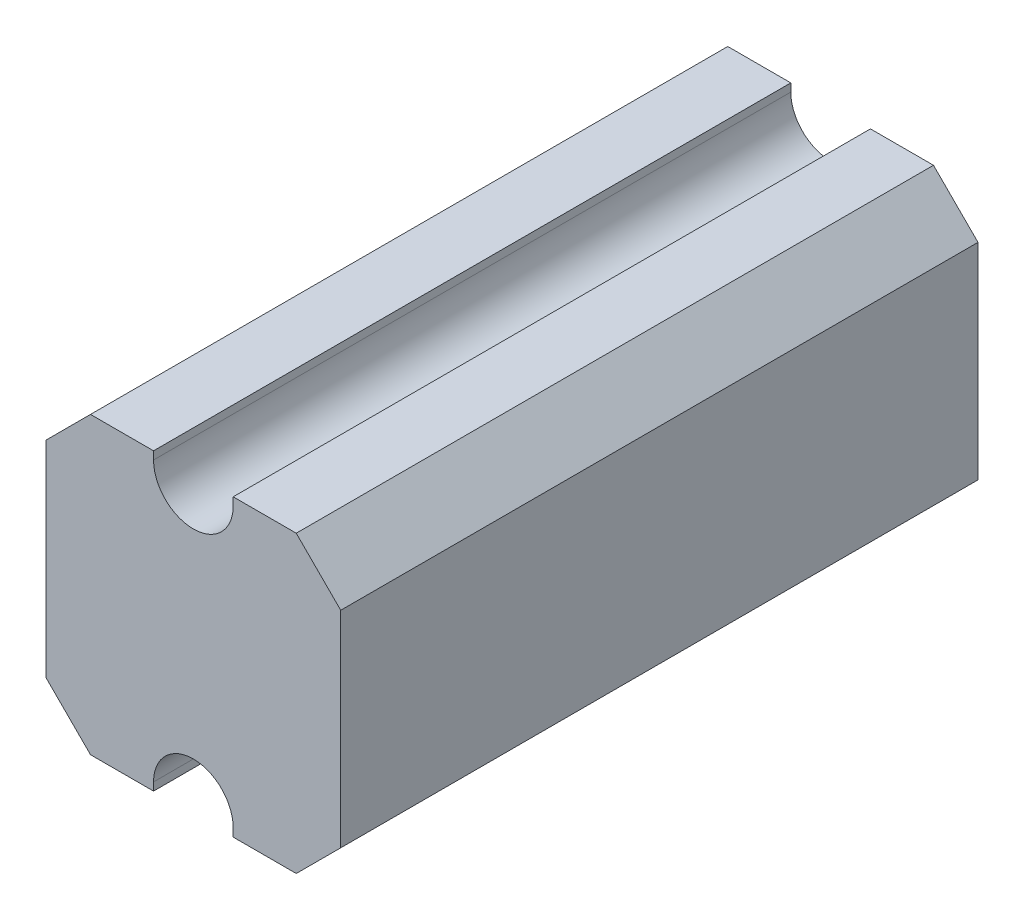
ISO-10303-21;
HEADER;
FILE_DESCRIPTION(('STEP AP214'),'2;1');
FILE_NAME('part.step','',(''),(''),'','','');
FILE_SCHEMA(('AUTOMOTIVE_DESIGN { 1 0 10303 214 1 1 1 1 }'));
ENDSEC;
DATA;
#1=APPLICATION_CONTEXT('core data for automotive mechanical design processes');
#2=APPLICATION_PROTOCOL_DEFINITION('international standard','automotive_design',2000,#1);
#3=PRODUCT_CONTEXT('',#1,'mechanical');
#4=PRODUCT('Part','Part','',(#3));
#5=PRODUCT_RELATED_PRODUCT_CATEGORY('part','',(#4));
#6=PRODUCT_DEFINITION_FORMATION('','',#4);
#7=PRODUCT_DEFINITION_CONTEXT('part definition',#1,'design');
#8=PRODUCT_DEFINITION('design','',#6,#7);
#9=PRODUCT_DEFINITION_SHAPE('','',#8);
#10=(LENGTH_UNIT() NAMED_UNIT(*) SI_UNIT(.MILLI.,.METRE.));
#11=(NAMED_UNIT(*) PLANE_ANGLE_UNIT() SI_UNIT($,.RADIAN.));
#12=(NAMED_UNIT(*) SI_UNIT($,.STERADIAN.) SOLID_ANGLE_UNIT());
#13=UNCERTAINTY_MEASURE_WITH_UNIT(LENGTH_MEASURE(1.E-05),#10,'distance_accuracy_value','');
#14=(GEOMETRIC_REPRESENTATION_CONTEXT(3) GLOBAL_UNCERTAINTY_ASSIGNED_CONTEXT((#13)) GLOBAL_UNIT_ASSIGNED_CONTEXT((#10,
#11,#12)) REPRESENTATION_CONTEXT('',''));
#15=CARTESIAN_POINT('',(0.,0.,0.));
#16=DIRECTION('',(0.,0.,1.));
#17=DIRECTION('',(1.,0.,0.));
#18=AXIS2_PLACEMENT_3D('',#15,#16,#17);
#19=CARTESIAN_POINT('',(-49.9999999999998,0.,-800.));
#20=DIRECTION('',(-1.,0.,0.));
#21=DIRECTION('',(0.,-1.,0.));
#22=AXIS2_PLACEMENT_3D('',#19,#20,#21);
#23=PLANE('',#22);
#24=DIRECTION('',(0.,-1.,0.));
#25=VECTOR('',#24,1.);
#26=CARTESIAN_POINT('',(-49.9999999999998,0.,0.));
#27=LINE('',#26,#25);
#28=CARTESIAN_POINT('',(-50.,-175.,0.));
#29=VERTEX_POINT('',#28);
#30=CARTESIAN_POINT('',(-50.,-185.,0.));
#31=VERTEX_POINT('',#30);
#32=EDGE_CURVE('E184',#29,#31,#27,.T.);
#33=ORIENTED_EDGE('',*,*,#32,.T.);
#34=DIRECTION('',(0.,0.,1.));
#35=VECTOR('',#34,1.);
#36=CARTESIAN_POINT('',(-50.,-185.,-800.));
#37=LINE('',#36,#35);
#38=CARTESIAN_POINT('',(-50.,-185.,-800.));
#39=VERTEX_POINT('',#38);
#40=EDGE_CURVE('E11',#39,#31,#37,.T.);
#41=ORIENTED_EDGE('',*,*,#40,.F.);
#42=DIRECTION('',(0.,-1.,0.));
#43=VECTOR('',#42,1.);
#44=CARTESIAN_POINT('',(-49.9999999999998,0.,-800.));
#45=LINE('',#44,#43);
#46=CARTESIAN_POINT('',(-50.,-175.,-800.));
#47=VERTEX_POINT('',#46);
#48=EDGE_CURVE('E60',#47,#39,#45,.T.);
#49=ORIENTED_EDGE('',*,*,#48,.F.);
#50=DIRECTION('',(0.,0.,1.));
#51=VECTOR('',#50,1.);
#52=CARTESIAN_POINT('',(-50.,-175.,-800.));
#53=LINE('',#52,#51);
#54=EDGE_CURVE('E45',#47,#29,#53,.T.);
#55=ORIENTED_EDGE('',*,*,#54,.T.);
#56=EDGE_LOOP('',(#33,#41,#49,#55));
#57=FACE_BOUND('',#56,.T.);
#58=ADVANCED_FACE('F42',(#57),#23,.F.);
#59=CARTESIAN_POINT('',(0.,-185.,-800.));
#60=DIRECTION('',(0.,-1.,0.));
#61=DIRECTION('',(0.,0.,-1.));
#62=AXIS2_PLACEMENT_3D('',#59,#60,#61);
#63=PLANE('',#62);
#64=DIRECTION('',(1.,0.,0.));
#65=VECTOR('',#64,1.);
#66=CARTESIAN_POINT('',(0.,-185.,0.));
#67=LINE('',#66,#65);
#68=CARTESIAN_POINT('',(-129.142135623731,-185.,0.));
#69=VERTEX_POINT('',#68);
#70=EDGE_CURVE('E222',#69,#31,#67,.T.);
#71=ORIENTED_EDGE('',*,*,#70,.F.);
#72=DIRECTION('',(0.,0.,1.));
#73=VECTOR('',#72,1.);
#74=CARTESIAN_POINT('',(-129.142135623731,-185.,-800.));
#75=LINE('',#74,#73);
#76=CARTESIAN_POINT('',(-129.142135623731,-185.,-800.));
#77=VERTEX_POINT('',#76);
#78=EDGE_CURVE('E51',#77,#69,#75,.T.);
#79=ORIENTED_EDGE('',*,*,#78,.F.);
#80=DIRECTION('',(1.,0.,0.));
#81=VECTOR('',#80,1.);
#82=CARTESIAN_POINT('',(0.,-185.,-800.));
#83=LINE('',#82,#81);
#84=EDGE_CURVE('E179',#77,#39,#83,.T.);
#85=ORIENTED_EDGE('',*,*,#84,.T.);
#86=ORIENTED_EDGE('',*,*,#40,.T.);
#87=EDGE_LOOP('',(#71,#79,#85,#86));
#88=FACE_BOUND('',#87,.T.);
#89=ADVANCED_FACE('F267',(#88),#63,.T.);
#90=CARTESIAN_POINT('',(-157.071067811865,-157.071067811865,-800.));
#91=DIRECTION('',(-0.707106781186548,-0.707106781186548,0.));
#92=DIRECTION('',(0.707106781186548,-0.707106781186548,0.));
#93=AXIS2_PLACEMENT_3D('',#90,#91,#92);
#94=PLANE('',#93);
#95=DIRECTION('',(0.707106781186548,-0.707106781186548,0.));
#96=VECTOR('',#95,1.);
#97=CARTESIAN_POINT('',(-157.071067811865,-157.071067811865,0.));
#98=LINE('',#97,#96);
#99=CARTESIAN_POINT('',(-185.,-129.142135623731,0.));
#100=VERTEX_POINT('',#99);
#101=EDGE_CURVE('E166',#100,#69,#98,.T.);
#102=ORIENTED_EDGE('',*,*,#101,.F.);
#103=DIRECTION('',(0.,0.,1.));
#104=VECTOR('',#103,1.);
#105=CARTESIAN_POINT('',(-185.,-129.142135623731,-800.));
#106=LINE('',#105,#104);
#107=CARTESIAN_POINT('',(-185.,-129.142135623731,-800.));
#108=VERTEX_POINT('',#107);
#109=EDGE_CURVE('E161',#108,#100,#106,.T.);
#110=ORIENTED_EDGE('',*,*,#109,.F.);
#111=DIRECTION('',(0.707106781186548,-0.707106781186548,0.));
#112=VECTOR('',#111,1.);
#113=CARTESIAN_POINT('',(-157.071067811865,-157.071067811865,-800.));
#114=LINE('',#113,#112);
#115=EDGE_CURVE('E165',#108,#77,#114,.T.);
#116=ORIENTED_EDGE('',*,*,#115,.T.);
#117=ORIENTED_EDGE('',*,*,#78,.T.);
#118=EDGE_LOOP('',(#102,#110,#116,#117));
#119=FACE_BOUND('',#118,.T.);
#120=ADVANCED_FACE('F163',(#119),#94,.T.);
#121=CARTESIAN_POINT('',(-185.,0.,-800.));
#122=DIRECTION('',(1.,0.,0.));
#123=DIRECTION('',(0.,0.,-1.));
#124=AXIS2_PLACEMENT_3D('',#121,#122,#123);
#125=PLANE('',#124);
#126=DIRECTION('',(0.,1.,0.));
#127=VECTOR('',#126,1.);
#128=CARTESIAN_POINT('',(-185.,0.,0.));
#129=LINE('',#128,#127);
#130=CARTESIAN_POINT('',(-185.,129.142135623731,0.));
#131=VERTEX_POINT('',#130);
#132=EDGE_CURVE('E219',#100,#131,#129,.T.);
#133=ORIENTED_EDGE('',*,*,#132,.T.);
#134=DIRECTION('',(0.,0.,1.));
#135=VECTOR('',#134,1.);
#136=CARTESIAN_POINT('',(-185.,129.142135623731,-800.));
#137=LINE('',#136,#135);
#138=CARTESIAN_POINT('',(-185.,129.142135623731,-800.));
#139=VERTEX_POINT('',#138);
#140=EDGE_CURVE('E169',#139,#131,#137,.T.);
#141=ORIENTED_EDGE('',*,*,#140,.F.);
#142=DIRECTION('',(0.,1.,0.));
#143=VECTOR('',#142,1.);
#144=CARTESIAN_POINT('',(-185.,0.,-800.));
#145=LINE('',#144,#143);
#146=EDGE_CURVE('E172',#108,#139,#145,.T.);
#147=ORIENTED_EDGE('',*,*,#146,.F.);
#148=ORIENTED_EDGE('',*,*,#109,.T.);
#149=EDGE_LOOP('',(#133,#141,#147,#148));
#150=FACE_BOUND('',#149,.T.);
#151=ADVANCED_FACE('F173',(#150),#125,.F.);
#152=CARTESIAN_POINT('',(-157.071067811865,157.071067811865,-800.));
#153=DIRECTION('',(0.707106781186548,-0.707106781186547,0.));
#154=DIRECTION('',(0.707106781186547,0.707106781186548,0.));
#155=AXIS2_PLACEMENT_3D('',#152,#153,#154);
#156=PLANE('',#155);
#157=DIRECTION('',(0.707106781186547,0.707106781186548,0.));
#158=VECTOR('',#157,1.);
#159=CARTESIAN_POINT('',(-157.071067811865,157.071067811865,0.));
#160=LINE('',#159,#158);
#161=CARTESIAN_POINT('',(-129.142135623731,185.,0.));
#162=VERTEX_POINT('',#161);
#163=EDGE_CURVE('E217',#131,#162,#160,.T.);
#164=ORIENTED_EDGE('',*,*,#163,.T.);
#165=DIRECTION('',(0.,0.,1.));
#166=VECTOR('',#165,1.);
#167=CARTESIAN_POINT('',(-129.142135623731,185.,-800.));
#168=LINE('',#167,#166);
#169=CARTESIAN_POINT('',(-129.142135623731,185.,-800.));
#170=VERTEX_POINT('',#169);
#171=EDGE_CURVE('E227',#170,#162,#168,.T.);
#172=ORIENTED_EDGE('',*,*,#171,.F.);
#173=DIRECTION('',(0.707106781186547,0.707106781186548,0.));
#174=VECTOR('',#173,1.);
#175=CARTESIAN_POINT('',(-157.071067811865,157.071067811865,-800.));
#176=LINE('',#175,#174);
#177=EDGE_CURVE('E176',#139,#170,#176,.T.);
#178=ORIENTED_EDGE('',*,*,#177,.F.);
#179=ORIENTED_EDGE('',*,*,#140,.T.);
#180=EDGE_LOOP('',(#164,#172,#178,#179));
#181=FACE_BOUND('',#180,.T.);
#182=ADVANCED_FACE('F280',(#181),#156,.F.);
#183=CARTESIAN_POINT('',(0.,185.,-800.));
#184=DIRECTION('',(0.,-1.,0.));
#185=DIRECTION('',(0.,0.,-1.));
#186=AXIS2_PLACEMENT_3D('',#183,#184,#185);
#187=PLANE('',#186);
#188=DIRECTION('',(1.,0.,0.));
#189=VECTOR('',#188,1.);
#190=CARTESIAN_POINT('',(0.,185.,0.));
#191=LINE('',#190,#189);
#192=CARTESIAN_POINT('',(-50.,185.,0.));
#193=VERTEX_POINT('',#192);
#194=EDGE_CURVE('E214',#162,#193,#191,.T.);
#195=ORIENTED_EDGE('',*,*,#194,.T.);
#196=DIRECTION('',(0.,0.,1.));
#197=VECTOR('',#196,1.);
#198=CARTESIAN_POINT('',(-50.,185.,-800.));
#199=LINE('',#198,#197);
#200=CARTESIAN_POINT('',(-50.,185.,-800.));
#201=VERTEX_POINT('',#200);
#202=EDGE_CURVE('E230',#201,#193,#199,.T.);
#203=ORIENTED_EDGE('',*,*,#202,.F.);
#204=DIRECTION('',(1.,0.,0.));
#205=VECTOR('',#204,1.);
#206=CARTESIAN_POINT('',(0.,185.,-800.));
#207=LINE('',#206,#205);
#208=EDGE_CURVE('E353',#170,#201,#207,.T.);
#209=ORIENTED_EDGE('',*,*,#208,.F.);
#210=ORIENTED_EDGE('',*,*,#171,.T.);
#211=EDGE_LOOP('',(#195,#203,#209,#210));
#212=FACE_BOUND('',#211,.T.);
#213=ADVANCED_FACE('F283',(#212),#187,.F.);
#214=CARTESIAN_POINT('',(-49.9999999999998,0.,-800.));
#215=DIRECTION('',(1.,0.,0.));
#216=DIRECTION('',(0.,1.,0.));
#217=AXIS2_PLACEMENT_3D('',#214,#215,#216);
#218=PLANE('',#217);
#219=DIRECTION('',(0.,1.,0.));
#220=VECTOR('',#219,1.);
#221=CARTESIAN_POINT('',(-49.9999999999998,0.,0.));
#222=LINE('',#221,#220);
#223=CARTESIAN_POINT('',(-50.,175.,0.));
#224=VERTEX_POINT('',#223);
#225=EDGE_CURVE('E211',#224,#193,#222,.T.);
#226=ORIENTED_EDGE('',*,*,#225,.F.);
#227=DIRECTION('',(0.,0.,1.));
#228=VECTOR('',#227,1.);
#229=CARTESIAN_POINT('',(-50.,175.,-800.));
#230=LINE('',#229,#228);
#231=CARTESIAN_POINT('',(-50.,175.,-800.));
#232=VERTEX_POINT('',#231);
#233=EDGE_CURVE('E232',#232,#224,#230,.T.);
#234=ORIENTED_EDGE('',*,*,#233,.F.);
#235=DIRECTION('',(0.,1.,0.));
#236=VECTOR('',#235,1.);
#237=CARTESIAN_POINT('',(-49.9999999999998,0.,-800.));
#238=LINE('',#237,#236);
#239=EDGE_CURVE('E350',#232,#201,#238,.T.);
#240=ORIENTED_EDGE('',*,*,#239,.T.);
#241=ORIENTED_EDGE('',*,*,#202,.T.);
#242=EDGE_LOOP('',(#226,#234,#240,#241));
#243=FACE_BOUND('',#242,.T.);
#244=ADVANCED_FACE('F287',(#243),#218,.T.);
#245=CARTESIAN_POINT('',(0.,175.,-800.));
#246=DIRECTION('',(0.,0.,1.));
#247=DIRECTION('',(1.,0.,0.));
#248=AXIS2_PLACEMENT_3D('',#245,#246,#247);
#249=CYLINDRICAL_SURFACE('',#248,50.);
#250=CARTESIAN_POINT('',(0.,175.,0.));
#251=DIRECTION('',(0.,0.,1.));
#252=DIRECTION('',(1.,0.,0.));
#253=AXIS2_PLACEMENT_3D('',#250,#251,#252);
#254=CIRCLE('',#253,50.);
#255=CARTESIAN_POINT('',(50.,175.,0.));
#256=VERTEX_POINT('',#255);
#257=EDGE_CURVE('E209',#224,#256,#254,.T.);
#258=ORIENTED_EDGE('',*,*,#257,.T.);
#259=DIRECTION('',(0.,0.,1.));
#260=VECTOR('',#259,1.);
#261=CARTESIAN_POINT('',(50.,175.,-800.));
#262=LINE('',#261,#260);
#263=CARTESIAN_POINT('',(50.,175.,-800.));
#264=VERTEX_POINT('',#263);
#265=EDGE_CURVE('E234',#264,#256,#262,.T.);
#266=ORIENTED_EDGE('',*,*,#265,.F.);
#267=CARTESIAN_POINT('',(0.,175.,-800.));
#268=DIRECTION('',(0.,0.,1.));
#269=DIRECTION('',(1.,0.,0.));
#270=AXIS2_PLACEMENT_3D('',#267,#268,#269);
#271=CIRCLE('',#270,50.);
#272=EDGE_CURVE('E348',#232,#264,#271,.T.);
#273=ORIENTED_EDGE('',*,*,#272,.F.);
#274=ORIENTED_EDGE('',*,*,#233,.T.);
#275=EDGE_LOOP('',(#258,#266,#273,#274));
#276=FACE_BOUND('',#275,.T.);
#277=ADVANCED_FACE('F291',(#276),#249,.F.);
#278=CARTESIAN_POINT('',(49.9999999999998,0.,-800.));
#279=DIRECTION('',(1.,0.,0.));
#280=DIRECTION('',(0.,1.,0.));
#281=AXIS2_PLACEMENT_3D('',#278,#279,#280);
#282=PLANE('',#281);
#283=DIRECTION('',(0.,1.,0.));
#284=VECTOR('',#283,1.);
#285=CARTESIAN_POINT('',(49.9999999999998,0.,0.));
#286=LINE('',#285,#284);
#287=CARTESIAN_POINT('',(50.,185.,0.));
#288=VERTEX_POINT('',#287);
#289=EDGE_CURVE('E206',#256,#288,#286,.T.);
#290=ORIENTED_EDGE('',*,*,#289,.T.);
#291=DIRECTION('',(0.,0.,1.));
#292=VECTOR('',#291,1.);
#293=CARTESIAN_POINT('',(50.,185.,-800.));
#294=LINE('',#293,#292);
#295=CARTESIAN_POINT('',(50.,185.,-800.));
#296=VERTEX_POINT('',#295);
#297=EDGE_CURVE('E237',#296,#288,#294,.T.);
#298=ORIENTED_EDGE('',*,*,#297,.F.);
#299=DIRECTION('',(0.,1.,0.));
#300=VECTOR('',#299,1.);
#301=CARTESIAN_POINT('',(49.9999999999998,0.,-800.));
#302=LINE('',#301,#300);
#303=EDGE_CURVE('E346',#264,#296,#302,.T.);
#304=ORIENTED_EDGE('',*,*,#303,.F.);
#305=ORIENTED_EDGE('',*,*,#265,.T.);
#306=EDGE_LOOP('',(#290,#298,#304,#305));
#307=FACE_BOUND('',#306,.T.);
#308=ADVANCED_FACE('F295',(#307),#282,.F.);
#309=CARTESIAN_POINT('',(0.,185.,-800.));
#310=DIRECTION('',(0.,1.,0.));
#311=DIRECTION('',(0.,0.,1.));
#312=AXIS2_PLACEMENT_3D('',#309,#310,#311);
#313=PLANE('',#312);
#314=DIRECTION('',(-1.,0.,0.));
#315=VECTOR('',#314,1.);
#316=CARTESIAN_POINT('',(0.,185.,0.));
#317=LINE('',#316,#315);
#318=CARTESIAN_POINT('',(129.142135623731,185.,0.));
#319=VERTEX_POINT('',#318);
#320=EDGE_CURVE('E203',#319,#288,#317,.T.);
#321=ORIENTED_EDGE('',*,*,#320,.F.);
#322=DIRECTION('',(0.,0.,1.));
#323=VECTOR('',#322,1.);
#324=CARTESIAN_POINT('',(129.142135623731,185.,-800.));
#325=LINE('',#324,#323);
#326=CARTESIAN_POINT('',(129.142135623731,185.,-800.));
#327=VERTEX_POINT('',#326);
#328=EDGE_CURVE('E239',#327,#319,#325,.T.);
#329=ORIENTED_EDGE('',*,*,#328,.F.);
#330=DIRECTION('',(-1.,0.,0.));
#331=VECTOR('',#330,1.);
#332=CARTESIAN_POINT('',(0.,185.,-800.));
#333=LINE('',#332,#331);
#334=EDGE_CURVE('E343',#327,#296,#333,.T.);
#335=ORIENTED_EDGE('',*,*,#334,.T.);
#336=ORIENTED_EDGE('',*,*,#297,.T.);
#337=EDGE_LOOP('',(#321,#329,#335,#336));
#338=FACE_BOUND('',#337,.T.);
#339=ADVANCED_FACE('F299',(#338),#313,.T.);
#340=CARTESIAN_POINT('',(157.071067811865,157.071067811865,-800.));
#341=DIRECTION('',(0.707106781186548,0.707106781186548,0.));
#342=DIRECTION('',(-0.707106781186548,0.707106781186548,0.));
#343=AXIS2_PLACEMENT_3D('',#340,#341,#342);
#344=PLANE('',#343);
#345=DIRECTION('',(-0.707106781186548,0.707106781186548,0.));
#346=VECTOR('',#345,1.);
#347=CARTESIAN_POINT('',(157.071067811865,157.071067811865,0.));
#348=LINE('',#347,#346);
#349=CARTESIAN_POINT('',(185.,129.142135623731,0.));
#350=VERTEX_POINT('',#349);
#351=EDGE_CURVE('E200',#350,#319,#348,.T.);
#352=ORIENTED_EDGE('',*,*,#351,.F.);
#353=DIRECTION('',(0.,0.,1.));
#354=VECTOR('',#353,1.);
#355=CARTESIAN_POINT('',(185.,129.142135623731,-800.));
#356=LINE('',#355,#354);
#357=CARTESIAN_POINT('',(185.,129.142135623731,-800.));
#358=VERTEX_POINT('',#357);
#359=EDGE_CURVE('E241',#358,#350,#356,.T.);
#360=ORIENTED_EDGE('',*,*,#359,.F.);
#361=DIRECTION('',(-0.707106781186548,0.707106781186548,0.));
#362=VECTOR('',#361,1.);
#363=CARTESIAN_POINT('',(157.071067811865,157.071067811865,-800.));
#364=LINE('',#363,#362);
#365=EDGE_CURVE('E340',#358,#327,#364,.T.);
#366=ORIENTED_EDGE('',*,*,#365,.T.);
#367=ORIENTED_EDGE('',*,*,#328,.T.);
#368=EDGE_LOOP('',(#352,#360,#366,#367));
#369=FACE_BOUND('',#368,.T.);
#370=ADVANCED_FACE('F303',(#369),#344,.T.);
#371=CARTESIAN_POINT('',(185.,0.,-800.));
#372=DIRECTION('',(1.,0.,0.));
#373=DIRECTION('',(0.,0.,-1.));
#374=AXIS2_PLACEMENT_3D('',#371,#372,#373);
#375=PLANE('',#374);
#376=DIRECTION('',(0.,1.,0.));
#377=VECTOR('',#376,1.);
#378=CARTESIAN_POINT('',(185.,0.,0.));
#379=LINE('',#378,#377);
#380=CARTESIAN_POINT('',(185.,-129.142135623731,0.));
#381=VERTEX_POINT('',#380);
#382=EDGE_CURVE('E197',#381,#350,#379,.T.);
#383=ORIENTED_EDGE('',*,*,#382,.F.);
#384=DIRECTION('',(0.,0.,1.));
#385=VECTOR('',#384,1.);
#386=CARTESIAN_POINT('',(185.,-129.142135623731,-800.));
#387=LINE('',#386,#385);
#388=CARTESIAN_POINT('',(185.,-129.142135623731,-800.));
#389=VERTEX_POINT('',#388);
#390=EDGE_CURVE('E243',#389,#381,#387,.T.);
#391=ORIENTED_EDGE('',*,*,#390,.F.);
#392=DIRECTION('',(0.,1.,0.));
#393=VECTOR('',#392,1.);
#394=CARTESIAN_POINT('',(185.,0.,-800.));
#395=LINE('',#394,#393);
#396=EDGE_CURVE('E337',#389,#358,#395,.T.);
#397=ORIENTED_EDGE('',*,*,#396,.T.);
#398=ORIENTED_EDGE('',*,*,#359,.T.);
#399=EDGE_LOOP('',(#383,#391,#397,#398));
#400=FACE_BOUND('',#399,.T.);
#401=ADVANCED_FACE('F307',(#400),#375,.T.);
#402=CARTESIAN_POINT('',(157.071067811865,-157.071067811865,-800.));
#403=DIRECTION('',(-0.707106781186548,0.707106781186548,0.));
#404=DIRECTION('',(-0.707106781186548,-0.707106781186548,0.));
#405=AXIS2_PLACEMENT_3D('',#402,#403,#404);
#406=PLANE('',#405);
#407=DIRECTION('',(-0.707106781186548,-0.707106781186548,0.));
#408=VECTOR('',#407,1.);
#409=CARTESIAN_POINT('',(157.071067811865,-157.071067811865,0.));
#410=LINE('',#409,#408);
#411=CARTESIAN_POINT('',(129.142135623731,-185.,0.));
#412=VERTEX_POINT('',#411);
#413=EDGE_CURVE('E195',#381,#412,#410,.T.);
#414=ORIENTED_EDGE('',*,*,#413,.T.);
#415=DIRECTION('',(0.,0.,1.));
#416=VECTOR('',#415,1.);
#417=CARTESIAN_POINT('',(129.142135623731,-185.,-800.));
#418=LINE('',#417,#416);
#419=CARTESIAN_POINT('',(129.142135623731,-185.,-800.));
#420=VERTEX_POINT('',#419);
#421=EDGE_CURVE('E245',#420,#412,#418,.T.);
#422=ORIENTED_EDGE('',*,*,#421,.F.);
#423=DIRECTION('',(-0.707106781186548,-0.707106781186548,0.));
#424=VECTOR('',#423,1.);
#425=CARTESIAN_POINT('',(157.071067811865,-157.071067811865,-800.));
#426=LINE('',#425,#424);
#427=EDGE_CURVE('E331',#389,#420,#426,.T.);
#428=ORIENTED_EDGE('',*,*,#427,.F.);
#429=ORIENTED_EDGE('',*,*,#390,.T.);
#430=EDGE_LOOP('',(#414,#422,#428,#429));
#431=FACE_BOUND('',#430,.T.);
#432=ADVANCED_FACE('F311',(#431),#406,.F.);
#433=CARTESIAN_POINT('',(0.,-185.,-800.));
#434=DIRECTION('',(0.,1.,0.));
#435=DIRECTION('',(0.,0.,1.));
#436=AXIS2_PLACEMENT_3D('',#433,#434,#435);
#437=PLANE('',#436);
#438=DIRECTION('',(-1.,0.,0.));
#439=VECTOR('',#438,1.);
#440=CARTESIAN_POINT('',(0.,-185.,0.));
#441=LINE('',#440,#439);
#442=CARTESIAN_POINT('',(50.,-185.,0.));
#443=VERTEX_POINT('',#442);
#444=EDGE_CURVE('E192',#412,#443,#441,.T.);
#445=ORIENTED_EDGE('',*,*,#444,.T.);
#446=DIRECTION('',(0.,0.,1.));
#447=VECTOR('',#446,1.);
#448=CARTESIAN_POINT('',(50.,-185.,-800.));
#449=LINE('',#448,#447);
#450=CARTESIAN_POINT('',(50.,-185.,-800.));
#451=VERTEX_POINT('',#450);
#452=EDGE_CURVE('E248',#451,#443,#449,.T.);
#453=ORIENTED_EDGE('',*,*,#452,.F.);
#454=DIRECTION('',(-1.,0.,0.));
#455=VECTOR('',#454,1.);
#456=CARTESIAN_POINT('',(0.,-185.,-800.));
#457=LINE('',#456,#455);
#458=EDGE_CURVE('E328',#420,#451,#457,.T.);
#459=ORIENTED_EDGE('',*,*,#458,.F.);
#460=ORIENTED_EDGE('',*,*,#421,.T.);
#461=EDGE_LOOP('',(#445,#453,#459,#460));
#462=FACE_BOUND('',#461,.T.);
#463=ADVANCED_FACE('F263',(#462),#437,.F.);
#464=CARTESIAN_POINT('',(49.9999999999998,0.,-800.));
#465=DIRECTION('',(-1.,0.,0.));
#466=DIRECTION('',(0.,-1.,0.));
#467=AXIS2_PLACEMENT_3D('',#464,#465,#466);
#468=PLANE('',#467);
#469=DIRECTION('',(0.,-1.,0.));
#470=VECTOR('',#469,1.);
#471=CARTESIAN_POINT('',(49.9999999999998,0.,0.));
#472=LINE('',#471,#470);
#473=CARTESIAN_POINT('',(50.,-175.,0.));
#474=VERTEX_POINT('',#473);
#475=EDGE_CURVE('E189',#474,#443,#472,.T.);
#476=ORIENTED_EDGE('',*,*,#475,.F.);
#477=DIRECTION('',(0.,0.,1.));
#478=VECTOR('',#477,1.);
#479=CARTESIAN_POINT('',(50.,-175.,-800.));
#480=LINE('',#479,#478);
#481=CARTESIAN_POINT('',(50.,-175.,-800.));
#482=VERTEX_POINT('',#481);
#483=EDGE_CURVE('E249',#482,#474,#480,.T.);
#484=ORIENTED_EDGE('',*,*,#483,.F.);
#485=DIRECTION('',(0.,-1.,0.));
#486=VECTOR('',#485,1.);
#487=CARTESIAN_POINT('',(49.9999999999998,0.,-800.));
#488=LINE('',#487,#486);
#489=EDGE_CURVE('E327',#482,#451,#488,.T.);
#490=ORIENTED_EDGE('',*,*,#489,.T.);
#491=ORIENTED_EDGE('',*,*,#452,.T.);
#492=EDGE_LOOP('',(#476,#484,#490,#491));
#493=FACE_BOUND('',#492,.T.);
#494=ADVANCED_FACE('F257',(#493),#468,.T.);
#495=CARTESIAN_POINT('',(0.,-175.,-800.));
#496=DIRECTION('',(0.,0.,1.));
#497=DIRECTION('',(1.,0.,0.));
#498=AXIS2_PLACEMENT_3D('',#495,#496,#497);
#499=CYLINDRICAL_SURFACE('',#498,50.);
#500=CARTESIAN_POINT('',(0.,-175.,0.));
#501=DIRECTION('',(0.,0.,1.));
#502=DIRECTION('',(1.,0.,0.));
#503=AXIS2_PLACEMENT_3D('',#500,#501,#502);
#504=CIRCLE('',#503,50.);
#505=EDGE_CURVE('E186',#29,#474,#504,.F.);
#506=ORIENTED_EDGE('',*,*,#505,.F.);
#507=ORIENTED_EDGE('',*,*,#54,.F.);
#508=CARTESIAN_POINT('',(0.,-175.,-800.));
#509=DIRECTION('',(0.,0.,1.));
#510=DIRECTION('',(1.,0.,0.));
#511=AXIS2_PLACEMENT_3D('',#508,#509,#510);
#512=CIRCLE('',#511,50.);
#513=EDGE_CURVE('E329',#47,#482,#512,.F.);
#514=ORIENTED_EDGE('',*,*,#513,.T.);
#515=ORIENTED_EDGE('',*,*,#483,.T.);
#516=EDGE_LOOP('',(#506,#507,#514,#515));
#517=FACE_BOUND('',#516,.T.);
#518=ADVANCED_FACE('F255',(#517),#499,.F.);
#519=CARTESIAN_POINT('',(0.,0.,-800.));
#520=DIRECTION('',(0.,0.,1.));
#521=DIRECTION('',(1.,0.,0.));
#522=AXIS2_PLACEMENT_3D('',#519,#520,#521);
#523=PLANE('',#522);
#524=ORIENTED_EDGE('',*,*,#48,.T.);
#525=ORIENTED_EDGE('',*,*,#84,.F.);
#526=ORIENTED_EDGE('',*,*,#115,.F.);
#527=ORIENTED_EDGE('',*,*,#146,.T.);
#528=ORIENTED_EDGE('',*,*,#177,.T.);
#529=ORIENTED_EDGE('',*,*,#208,.T.);
#530=ORIENTED_EDGE('',*,*,#239,.F.);
#531=ORIENTED_EDGE('',*,*,#272,.T.);
#532=ORIENTED_EDGE('',*,*,#303,.T.);
#533=ORIENTED_EDGE('',*,*,#334,.F.);
#534=ORIENTED_EDGE('',*,*,#365,.F.);
#535=ORIENTED_EDGE('',*,*,#396,.F.);
#536=ORIENTED_EDGE('',*,*,#427,.T.);
#537=ORIENTED_EDGE('',*,*,#458,.T.);
#538=ORIENTED_EDGE('',*,*,#489,.F.);
#539=ORIENTED_EDGE('',*,*,#513,.F.);
#540=EDGE_LOOP('',(#524,#525,#526,#527,#528,#529,#530,#531,#532,#533,#534,#535,#536,#537,#538,#539));
#541=FACE_BOUND('',#540,.T.);
#542=ADVANCED_FACE('F178',(#541),#523,.F.);
#543=CARTESIAN_POINT('',(0.,0.,0.));
#544=DIRECTION('',(0.,0.,1.));
#545=DIRECTION('',(1.,0.,0.));
#546=AXIS2_PLACEMENT_3D('',#543,#544,#545);
#547=PLANE('',#546);
#548=ORIENTED_EDGE('',*,*,#32,.F.);
#549=ORIENTED_EDGE('',*,*,#505,.T.);
#550=ORIENTED_EDGE('',*,*,#475,.T.);
#551=ORIENTED_EDGE('',*,*,#444,.F.);
#552=ORIENTED_EDGE('',*,*,#413,.F.);
#553=ORIENTED_EDGE('',*,*,#382,.T.);
#554=ORIENTED_EDGE('',*,*,#351,.T.);
#555=ORIENTED_EDGE('',*,*,#320,.T.);
#556=ORIENTED_EDGE('',*,*,#289,.F.);
#557=ORIENTED_EDGE('',*,*,#257,.F.);
#558=ORIENTED_EDGE('',*,*,#225,.T.);
#559=ORIENTED_EDGE('',*,*,#194,.F.);
#560=ORIENTED_EDGE('',*,*,#163,.F.);
#561=ORIENTED_EDGE('',*,*,#132,.F.);
#562=ORIENTED_EDGE('',*,*,#101,.T.);
#563=ORIENTED_EDGE('',*,*,#70,.T.);
#564=EDGE_LOOP('',(#548,#549,#550,#551,#552,#553,#554,#555,#556,#557,#558,#559,#560,#561,#562,#563));
#565=FACE_BOUND('',#564,.T.);
#566=ADVANCED_FACE('F254',(#565),#547,.T.);
#567=CLOSED_SHELL('',(#58,#89,#120,#151,#182,#213,#244,#277,#308,#339,#370,#401,#432,#463,#494,
#518,#542,#566));
#568=MANIFOLD_SOLID_BREP('B2',#567);
#569=ADVANCED_BREP_SHAPE_REPRESENTATION('',(#18,#568),#14);
#570=SHAPE_DEFINITION_REPRESENTATION(#9,#569);
ENDSEC;
END-ISO-10303-21;
